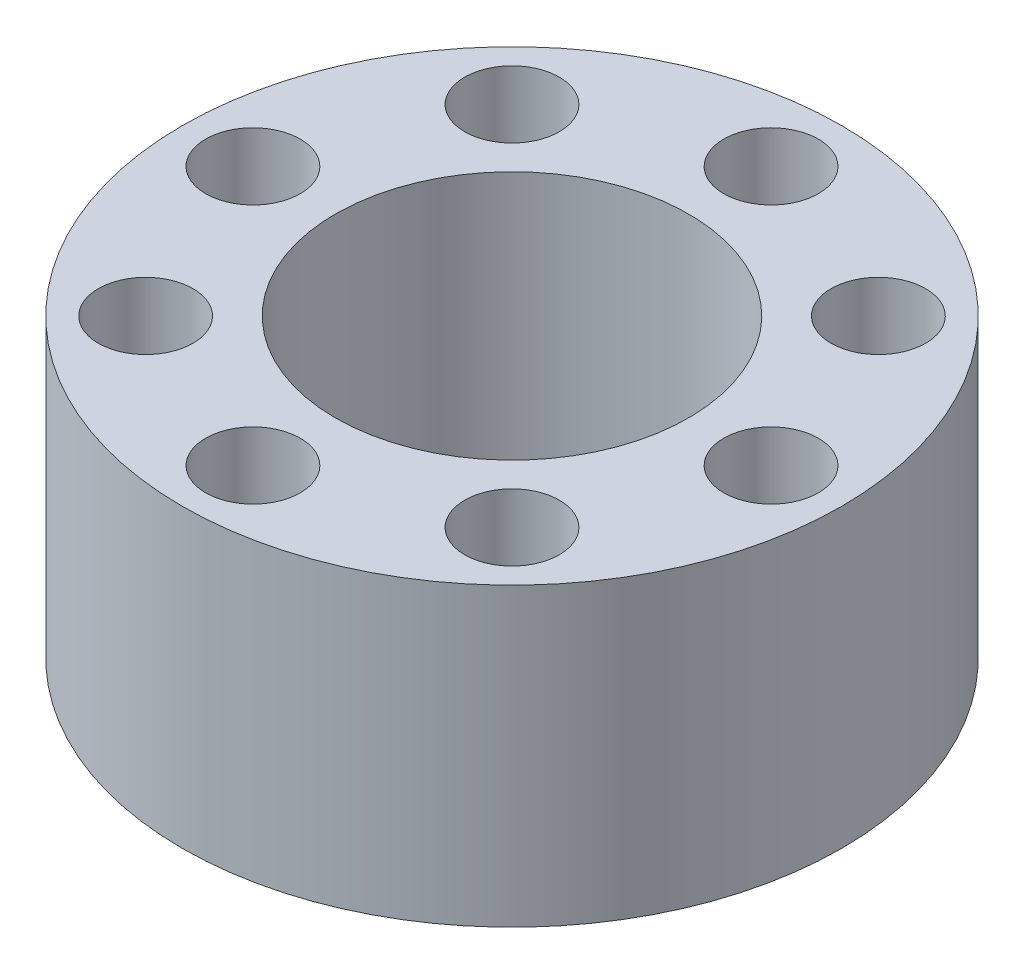
ISO-10303-21;
HEADER;
FILE_DESCRIPTION(('STEP AP214'),'2;1');
FILE_NAME('part.step','',(''),(''),'','','');
FILE_SCHEMA(('AUTOMOTIVE_DESIGN { 1 0 10303 214 1 1 1 1 }'));
ENDSEC;
DATA;
#1=APPLICATION_CONTEXT('core data for automotive mechanical design processes');
#2=APPLICATION_PROTOCOL_DEFINITION('international standard','automotive_design',2000,#1);
#3=PRODUCT_CONTEXT('',#1,'mechanical');
#4=PRODUCT('Part','Part','',(#3));
#5=PRODUCT_RELATED_PRODUCT_CATEGORY('part','',(#4));
#6=PRODUCT_DEFINITION_FORMATION('','',#4);
#7=PRODUCT_DEFINITION_CONTEXT('part definition',#1,'design');
#8=PRODUCT_DEFINITION('design','',#6,#7);
#9=PRODUCT_DEFINITION_SHAPE('','',#8);
#10=(LENGTH_UNIT() NAMED_UNIT(*) SI_UNIT(.MILLI.,.METRE.));
#11=(NAMED_UNIT(*) PLANE_ANGLE_UNIT() SI_UNIT($,.RADIAN.));
#12=(NAMED_UNIT(*) SI_UNIT($,.STERADIAN.) SOLID_ANGLE_UNIT());
#13=UNCERTAINTY_MEASURE_WITH_UNIT(LENGTH_MEASURE(1.E-05),#10,'distance_accuracy_value','');
#14=(GEOMETRIC_REPRESENTATION_CONTEXT(3) GLOBAL_UNCERTAINTY_ASSIGNED_CONTEXT((#13)) GLOBAL_UNIT_ASSIGNED_CONTEXT((#10,
#11,#12)) REPRESENTATION_CONTEXT('',''));
#15=CARTESIAN_POINT('',(0.,0.,0.));
#16=DIRECTION('',(0.,0.,1.));
#17=DIRECTION('',(1.,0.,0.));
#18=AXIS2_PLACEMENT_3D('',#15,#16,#17);
#19=CARTESIAN_POINT('',(0.,15.9766,0.));
#20=DIRECTION('',(0.,1.,0.));
#21=DIRECTION('',(0.,0.,1.));
#22=AXIS2_PLACEMENT_3D('',#19,#20,#21);
#23=PLANE('',#22);
#24=CARTESIAN_POINT('',(-13.97,15.9766,0.));
#25=DIRECTION('',(0.,1.,0.));
#26=DIRECTION('',(0.,0.,1.));
#27=AXIS2_PLACEMENT_3D('',#24,#25,#26);
#28=CIRCLE('',#27,2.5527);
#29=CARTESIAN_POINT('',(-13.97,15.9766,2.5527));
#30=VERTEX_POINT('',#29);
#31=EDGE_CURVE('E84',#30,#30,#28,.T.);
#32=ORIENTED_EDGE('',*,*,#31,.F.);
#33=EDGE_LOOP('',(#32));
#34=FACE_BOUND('',#33,.T.);
#35=CARTESIAN_POINT('',(0.,15.9766,13.97));
#36=DIRECTION('',(0.,1.,0.));
#37=DIRECTION('',(0.,0.,1.));
#38=AXIS2_PLACEMENT_3D('',#35,#36,#37);
#39=CIRCLE('',#38,2.5527);
#40=CARTESIAN_POINT('',(0.,15.9766,16.5227));
#41=VERTEX_POINT('',#40);
#42=EDGE_CURVE('E72',#41,#41,#39,.T.);
#43=ORIENTED_EDGE('',*,*,#42,.F.);
#44=EDGE_LOOP('',(#43));
#45=FACE_BOUND('',#44,.T.);
#46=CARTESIAN_POINT('',(13.97,15.9766,0.));
#47=DIRECTION('',(0.,1.,0.));
#48=DIRECTION('',(0.,0.,1.));
#49=AXIS2_PLACEMENT_3D('',#46,#47,#48);
#50=CIRCLE('',#49,2.5527);
#51=CARTESIAN_POINT('',(13.97,15.9766,2.5527));
#52=VERTEX_POINT('',#51);
#53=EDGE_CURVE('E60',#52,#52,#50,.T.);
#54=ORIENTED_EDGE('',*,*,#53,.F.);
#55=EDGE_LOOP('',(#54));
#56=FACE_BOUND('',#55,.T.);
#57=CARTESIAN_POINT('',(9.87828173317607,15.9766,-9.87828173317607));
#58=DIRECTION('',(0.,1.,0.));
#59=DIRECTION('',(0.,0.,1.));
#60=AXIS2_PLACEMENT_3D('',#57,#58,#59);
#61=CIRCLE('',#60,2.5527);
#62=CARTESIAN_POINT('',(9.87828173317607,15.9766,-7.32558173317607));
#63=VERTEX_POINT('',#62);
#64=EDGE_CURVE('E48',#63,#63,#61,.T.);
#65=ORIENTED_EDGE('',*,*,#64,.F.);
#66=EDGE_LOOP('',(#65));
#67=FACE_BOUND('',#66,.T.);
#68=CARTESIAN_POINT('',(0.,15.9766,0.));
#69=DIRECTION('',(0.,1.,0.));
#70=DIRECTION('',(0.,0.,1.));
#71=AXIS2_PLACEMENT_3D('',#68,#69,#70);
#72=CIRCLE('',#71,17.78);
#73=CARTESIAN_POINT('',(0.,15.9766,17.78));
#74=VERTEX_POINT('',#73);
#75=EDGE_CURVE('E10',#74,#74,#72,.T.);
#76=ORIENTED_EDGE('',*,*,#75,.T.);
#77=EDGE_LOOP('',(#76));
#78=FACE_BOUND('',#77,.T.);
#79=CARTESIAN_POINT('',(0.,15.9766,-13.97));
#80=DIRECTION('',(0.,1.,0.));
#81=DIRECTION('',(0.,0.,1.));
#82=AXIS2_PLACEMENT_3D('',#79,#80,#81);
#83=CIRCLE('',#82,2.5527);
#84=CARTESIAN_POINT('',(0.,15.9766,-11.4173));
#85=VERTEX_POINT('',#84);
#86=EDGE_CURVE('E43',#85,#85,#83,.T.);
#87=ORIENTED_EDGE('',*,*,#86,.F.);
#88=EDGE_LOOP('',(#87));
#89=FACE_BOUND('',#88,.T.);
#90=CARTESIAN_POINT('',(0.,15.9766,0.));
#91=DIRECTION('',(0.,1.,0.));
#92=DIRECTION('',(0.,0.,1.));
#93=AXIS2_PLACEMENT_3D('',#90,#91,#92);
#94=CIRCLE('',#93,9.525);
#95=CARTESIAN_POINT('',(0.,15.9766,9.525));
#96=VERTEX_POINT('',#95);
#97=EDGE_CURVE('E54',#96,#96,#94,.T.);
#98=ORIENTED_EDGE('',*,*,#97,.F.);
#99=EDGE_LOOP('',(#98));
#100=FACE_BOUND('',#99,.T.);
#101=CARTESIAN_POINT('',(9.87828173317607,15.9766,9.87828173317607));
#102=DIRECTION('',(0.,1.,0.));
#103=DIRECTION('',(0.,0.,1.));
#104=AXIS2_PLACEMENT_3D('',#101,#102,#103);
#105=CIRCLE('',#104,2.5527);
#106=CARTESIAN_POINT('',(9.87828173317607,15.9766,12.4309817331761));
#107=VERTEX_POINT('',#106);
#108=EDGE_CURVE('E66',#107,#107,#105,.T.);
#109=ORIENTED_EDGE('',*,*,#108,.F.);
#110=EDGE_LOOP('',(#109));
#111=FACE_BOUND('',#110,.T.);
#112=CARTESIAN_POINT('',(-9.87828173317607,15.9766,9.87828173317607));
#113=DIRECTION('',(0.,1.,0.));
#114=DIRECTION('',(0.,0.,1.));
#115=AXIS2_PLACEMENT_3D('',#112,#113,#114);
#116=CIRCLE('',#115,2.5527);
#117=CARTESIAN_POINT('',(-9.87828173317607,15.9766,12.4309817331761));
#118=VERTEX_POINT('',#117);
#119=EDGE_CURVE('E78',#118,#118,#116,.T.);
#120=ORIENTED_EDGE('',*,*,#119,.F.);
#121=EDGE_LOOP('',(#120));
#122=FACE_BOUND('',#121,.T.);
#123=CARTESIAN_POINT('',(-9.87828173317607,15.9766,-9.87828173317607));
#124=DIRECTION('',(0.,1.,0.));
#125=DIRECTION('',(0.,0.,1.));
#126=AXIS2_PLACEMENT_3D('',#123,#124,#125);
#127=CIRCLE('',#126,2.5527);
#128=CARTESIAN_POINT('',(-9.87828173317607,15.9766,-7.32558173317607));
#129=VERTEX_POINT('',#128);
#130=EDGE_CURVE('E90',#129,#129,#127,.T.);
#131=ORIENTED_EDGE('',*,*,#130,.F.);
#132=EDGE_LOOP('',(#131));
#133=FACE_BOUND('',#132,.T.);
#134=ADVANCED_FACE('F32',(#34,#45,#56,#67,#78,#89,#100,#111,#122,#133),#23,.T.);
#135=CARTESIAN_POINT('',(0.,0.,0.));
#136=DIRECTION('',(0.,1.,0.));
#137=DIRECTION('',(0.,0.,1.));
#138=AXIS2_PLACEMENT_3D('',#135,#136,#137);
#139=PLANE('',#138);
#140=CARTESIAN_POINT('',(0.,0.,0.));
#141=DIRECTION('',(0.,1.,0.));
#142=DIRECTION('',(0.,0.,1.));
#143=AXIS2_PLACEMENT_3D('',#140,#141,#142);
#144=CIRCLE('',#143,17.78);
#145=CARTESIAN_POINT('',(0.,0.,17.78));
#146=VERTEX_POINT('',#145);
#147=EDGE_CURVE('E36',#146,#146,#144,.T.);
#148=ORIENTED_EDGE('',*,*,#147,.F.);
#149=EDGE_LOOP('',(#148));
#150=FACE_BOUND('',#149,.T.);
#151=CARTESIAN_POINT('',(0.,0.,-13.97));
#152=DIRECTION('',(0.,1.,0.));
#153=DIRECTION('',(0.,0.,1.));
#154=AXIS2_PLACEMENT_3D('',#151,#152,#153);
#155=CIRCLE('',#154,2.5527);
#156=CARTESIAN_POINT('',(0.,0.,-11.4173));
#157=VERTEX_POINT('',#156);
#158=EDGE_CURVE('E45',#157,#157,#155,.T.);
#159=ORIENTED_EDGE('',*,*,#158,.T.);
#160=EDGE_LOOP('',(#159));
#161=FACE_BOUND('',#160,.T.);
#162=CARTESIAN_POINT('',(9.87828173317607,0.,-9.87828173317607));
#163=DIRECTION('',(0.,1.,0.));
#164=DIRECTION('',(0.,0.,1.));
#165=AXIS2_PLACEMENT_3D('',#162,#163,#164);
#166=CIRCLE('',#165,2.5527);
#167=CARTESIAN_POINT('',(9.87828173317607,0.,-7.32558173317607));
#168=VERTEX_POINT('',#167);
#169=EDGE_CURVE('E51',#168,#168,#166,.T.);
#170=ORIENTED_EDGE('',*,*,#169,.T.);
#171=EDGE_LOOP('',(#170));
#172=FACE_BOUND('',#171,.T.);
#173=CARTESIAN_POINT('',(0.,0.,0.));
#174=DIRECTION('',(0.,1.,0.));
#175=DIRECTION('',(0.,0.,1.));
#176=AXIS2_PLACEMENT_3D('',#173,#174,#175);
#177=CIRCLE('',#176,9.525);
#178=CARTESIAN_POINT('',(0.,0.,9.525));
#179=VERTEX_POINT('',#178);
#180=EDGE_CURVE('E57',#179,#179,#177,.T.);
#181=ORIENTED_EDGE('',*,*,#180,.T.);
#182=EDGE_LOOP('',(#181));
#183=FACE_BOUND('',#182,.T.);
#184=CARTESIAN_POINT('',(13.97,0.,0.));
#185=DIRECTION('',(0.,1.,0.));
#186=DIRECTION('',(0.,0.,1.));
#187=AXIS2_PLACEMENT_3D('',#184,#185,#186);
#188=CIRCLE('',#187,2.5527);
#189=CARTESIAN_POINT('',(13.97,0.,2.5527));
#190=VERTEX_POINT('',#189);
#191=EDGE_CURVE('E63',#190,#190,#188,.T.);
#192=ORIENTED_EDGE('',*,*,#191,.T.);
#193=EDGE_LOOP('',(#192));
#194=FACE_BOUND('',#193,.T.);
#195=CARTESIAN_POINT('',(9.87828173317607,0.,9.87828173317607));
#196=DIRECTION('',(0.,1.,0.));
#197=DIRECTION('',(0.,0.,1.));
#198=AXIS2_PLACEMENT_3D('',#195,#196,#197);
#199=CIRCLE('',#198,2.5527);
#200=CARTESIAN_POINT('',(9.87828173317607,0.,12.4309817331761));
#201=VERTEX_POINT('',#200);
#202=EDGE_CURVE('E69',#201,#201,#199,.T.);
#203=ORIENTED_EDGE('',*,*,#202,.T.);
#204=EDGE_LOOP('',(#203));
#205=FACE_BOUND('',#204,.T.);
#206=CARTESIAN_POINT('',(0.,0.,13.97));
#207=DIRECTION('',(0.,1.,0.));
#208=DIRECTION('',(0.,0.,1.));
#209=AXIS2_PLACEMENT_3D('',#206,#207,#208);
#210=CIRCLE('',#209,2.5527);
#211=CARTESIAN_POINT('',(0.,0.,16.5227));
#212=VERTEX_POINT('',#211);
#213=EDGE_CURVE('E75',#212,#212,#210,.T.);
#214=ORIENTED_EDGE('',*,*,#213,.T.);
#215=EDGE_LOOP('',(#214));
#216=FACE_BOUND('',#215,.T.);
#217=CARTESIAN_POINT('',(-9.87828173317607,0.,9.87828173317607));
#218=DIRECTION('',(0.,1.,0.));
#219=DIRECTION('',(0.,0.,1.));
#220=AXIS2_PLACEMENT_3D('',#217,#218,#219);
#221=CIRCLE('',#220,2.5527);
#222=CARTESIAN_POINT('',(-9.87828173317607,0.,12.4309817331761));
#223=VERTEX_POINT('',#222);
#224=EDGE_CURVE('E81',#223,#223,#221,.T.);
#225=ORIENTED_EDGE('',*,*,#224,.T.);
#226=EDGE_LOOP('',(#225));
#227=FACE_BOUND('',#226,.T.);
#228=CARTESIAN_POINT('',(-13.97,0.,0.));
#229=DIRECTION('',(0.,1.,0.));
#230=DIRECTION('',(0.,0.,1.));
#231=AXIS2_PLACEMENT_3D('',#228,#229,#230);
#232=CIRCLE('',#231,2.5527);
#233=CARTESIAN_POINT('',(-13.97,0.,2.5527));
#234=VERTEX_POINT('',#233);
#235=EDGE_CURVE('E87',#234,#234,#232,.T.);
#236=ORIENTED_EDGE('',*,*,#235,.T.);
#237=EDGE_LOOP('',(#236));
#238=FACE_BOUND('',#237,.T.);
#239=CARTESIAN_POINT('',(-9.87828173317607,0.,-9.87828173317607));
#240=DIRECTION('',(0.,1.,0.));
#241=DIRECTION('',(0.,0.,1.));
#242=AXIS2_PLACEMENT_3D('',#239,#240,#241);
#243=CIRCLE('',#242,2.5527);
#244=CARTESIAN_POINT('',(-9.87828173317607,0.,-7.32558173317607));
#245=VERTEX_POINT('',#244);
#246=EDGE_CURVE('E93',#245,#245,#243,.T.);
#247=ORIENTED_EDGE('',*,*,#246,.T.);
#248=EDGE_LOOP('',(#247));
#249=FACE_BOUND('',#248,.T.);
#250=ADVANCED_FACE('F103',(#150,#161,#172,#183,#194,#205,#216,#227,#238,#249),#139,.F.);
#251=CARTESIAN_POINT('',(0.,15.9766,0.));
#252=DIRECTION('',(0.,-1.,0.));
#253=DIRECTION('',(0.,0.,-1.));
#254=AXIS2_PLACEMENT_3D('',#251,#252,#253);
#255=CYLINDRICAL_SURFACE('',#254,17.78);
#256=ORIENTED_EDGE('',*,*,#75,.F.);
#257=EDGE_LOOP('',(#256));
#258=FACE_BOUND('',#257,.T.);
#259=ORIENTED_EDGE('',*,*,#147,.T.);
#260=EDGE_LOOP('',(#259));
#261=FACE_BOUND('',#260,.T.);
#262=ADVANCED_FACE('F34',(#258,#261),#255,.T.);
#263=CARTESIAN_POINT('',(0.,15.9766,-13.97));
#264=DIRECTION('',(0.,-1.,0.));
#265=DIRECTION('',(0.,0.,-1.));
#266=AXIS2_PLACEMENT_3D('',#263,#264,#265);
#267=CYLINDRICAL_SURFACE('',#266,2.5527);
#268=ORIENTED_EDGE('',*,*,#86,.T.);
#269=EDGE_LOOP('',(#268));
#270=FACE_BOUND('',#269,.T.);
#271=ORIENTED_EDGE('',*,*,#158,.F.);
#272=EDGE_LOOP('',(#271));
#273=FACE_BOUND('',#272,.T.);
#274=ADVANCED_FACE('F113',(#270,#273),#267,.F.);
#275=CARTESIAN_POINT('',(9.87828173317607,15.9766,-9.87828173317607));
#276=DIRECTION('',(0.,-1.,0.));
#277=DIRECTION('',(0.,0.,-1.));
#278=AXIS2_PLACEMENT_3D('',#275,#276,#277);
#279=CYLINDRICAL_SURFACE('',#278,2.5527);
#280=ORIENTED_EDGE('',*,*,#64,.T.);
#281=EDGE_LOOP('',(#280));
#282=FACE_BOUND('',#281,.T.);
#283=ORIENTED_EDGE('',*,*,#169,.F.);
#284=EDGE_LOOP('',(#283));
#285=FACE_BOUND('',#284,.T.);
#286=ADVANCED_FACE('F116',(#282,#285),#279,.F.);
#287=CARTESIAN_POINT('',(0.,15.9766,0.));
#288=DIRECTION('',(0.,-1.,0.));
#289=DIRECTION('',(0.,0.,-1.));
#290=AXIS2_PLACEMENT_3D('',#287,#288,#289);
#291=CYLINDRICAL_SURFACE('',#290,9.525);
#292=ORIENTED_EDGE('',*,*,#97,.T.);
#293=EDGE_LOOP('',(#292));
#294=FACE_BOUND('',#293,.T.);
#295=ORIENTED_EDGE('',*,*,#180,.F.);
#296=EDGE_LOOP('',(#295));
#297=FACE_BOUND('',#296,.T.);
#298=ADVANCED_FACE('F120',(#294,#297),#291,.F.);
#299=CARTESIAN_POINT('',(13.97,15.9766,0.));
#300=DIRECTION('',(0.,-1.,0.));
#301=DIRECTION('',(0.,0.,-1.));
#302=AXIS2_PLACEMENT_3D('',#299,#300,#301);
#303=CYLINDRICAL_SURFACE('',#302,2.5527);
#304=ORIENTED_EDGE('',*,*,#53,.T.);
#305=EDGE_LOOP('',(#304));
#306=FACE_BOUND('',#305,.T.);
#307=ORIENTED_EDGE('',*,*,#191,.F.);
#308=EDGE_LOOP('',(#307));
#309=FACE_BOUND('',#308,.T.);
#310=ADVANCED_FACE('F124',(#306,#309),#303,.F.);
#311=CARTESIAN_POINT('',(9.87828173317607,15.9766,9.87828173317607));
#312=DIRECTION('',(0.,-1.,0.));
#313=DIRECTION('',(0.,0.,-1.));
#314=AXIS2_PLACEMENT_3D('',#311,#312,#313);
#315=CYLINDRICAL_SURFACE('',#314,2.5527);
#316=ORIENTED_EDGE('',*,*,#108,.T.);
#317=EDGE_LOOP('',(#316));
#318=FACE_BOUND('',#317,.T.);
#319=ORIENTED_EDGE('',*,*,#202,.F.);
#320=EDGE_LOOP('',(#319));
#321=FACE_BOUND('',#320,.T.);
#322=ADVANCED_FACE('F128',(#318,#321),#315,.F.);
#323=CARTESIAN_POINT('',(0.,15.9766,13.97));
#324=DIRECTION('',(0.,-1.,0.));
#325=DIRECTION('',(0.,0.,-1.));
#326=AXIS2_PLACEMENT_3D('',#323,#324,#325);
#327=CYLINDRICAL_SURFACE('',#326,2.5527);
#328=ORIENTED_EDGE('',*,*,#42,.T.);
#329=EDGE_LOOP('',(#328));
#330=FACE_BOUND('',#329,.T.);
#331=ORIENTED_EDGE('',*,*,#213,.F.);
#332=EDGE_LOOP('',(#331));
#333=FACE_BOUND('',#332,.T.);
#334=ADVANCED_FACE('F132',(#330,#333),#327,.F.);
#335=CARTESIAN_POINT('',(-9.87828173317607,15.9766,9.87828173317607));
#336=DIRECTION('',(0.,-1.,0.));
#337=DIRECTION('',(0.,0.,-1.));
#338=AXIS2_PLACEMENT_3D('',#335,#336,#337);
#339=CYLINDRICAL_SURFACE('',#338,2.5527);
#340=ORIENTED_EDGE('',*,*,#119,.T.);
#341=EDGE_LOOP('',(#340));
#342=FACE_BOUND('',#341,.T.);
#343=ORIENTED_EDGE('',*,*,#224,.F.);
#344=EDGE_LOOP('',(#343));
#345=FACE_BOUND('',#344,.T.);
#346=ADVANCED_FACE('F136',(#342,#345),#339,.F.);
#347=CARTESIAN_POINT('',(-13.97,15.9766,0.));
#348=DIRECTION('',(0.,-1.,0.));
#349=DIRECTION('',(0.,0.,-1.));
#350=AXIS2_PLACEMENT_3D('',#347,#348,#349);
#351=CYLINDRICAL_SURFACE('',#350,2.5527);
#352=ORIENTED_EDGE('',*,*,#31,.T.);
#353=EDGE_LOOP('',(#352));
#354=FACE_BOUND('',#353,.T.);
#355=ORIENTED_EDGE('',*,*,#235,.F.);
#356=EDGE_LOOP('',(#355));
#357=FACE_BOUND('',#356,.T.);
#358=ADVANCED_FACE('F140',(#354,#357),#351,.F.);
#359=CARTESIAN_POINT('',(-9.87828173317607,15.9766,-9.87828173317607));
#360=DIRECTION('',(0.,-1.,0.));
#361=DIRECTION('',(0.,0.,-1.));
#362=AXIS2_PLACEMENT_3D('',#359,#360,#361);
#363=CYLINDRICAL_SURFACE('',#362,2.5527);
#364=ORIENTED_EDGE('',*,*,#130,.T.);
#365=EDGE_LOOP('',(#364));
#366=FACE_BOUND('',#365,.T.);
#367=ORIENTED_EDGE('',*,*,#246,.F.);
#368=EDGE_LOOP('',(#367));
#369=FACE_BOUND('',#368,.T.);
#370=ADVANCED_FACE('F99',(#366,#369),#363,.F.);
#371=CLOSED_SHELL('',(#134,#250,#262,#274,#286,#298,#310,#322,#334,#346,#358,#370));
#372=MANIFOLD_SOLID_BREP('B2',#371);
#373=ADVANCED_BREP_SHAPE_REPRESENTATION('',(#18,#372),#14);
#374=SHAPE_DEFINITION_REPRESENTATION(#9,#373);
ENDSEC;
END-ISO-10303-21;
